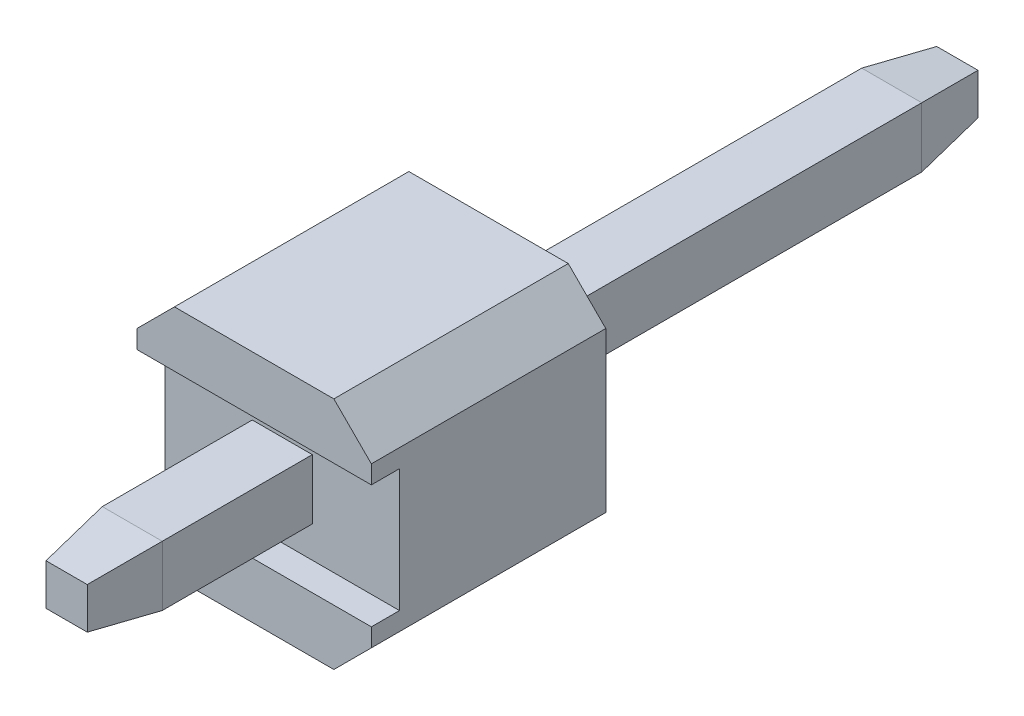
ISO-10303-21;
HEADER;
FILE_DESCRIPTION(('STEP AP214'),'2;1');
FILE_NAME('part.step','',(''),(''),'','','');
FILE_SCHEMA(('AUTOMOTIVE_DESIGN { 1 0 10303 214 1 1 1 1 }'));
ENDSEC;
DATA;
#1=APPLICATION_CONTEXT('core data for automotive mechanical design processes');
#2=APPLICATION_PROTOCOL_DEFINITION('international standard','automotive_design',2000,#1);
#3=PRODUCT_CONTEXT('',#1,'mechanical');
#4=PRODUCT('Part','Part','',(#3));
#5=PRODUCT_RELATED_PRODUCT_CATEGORY('part','',(#4));
#6=PRODUCT_DEFINITION_FORMATION('','',#4);
#7=PRODUCT_DEFINITION_CONTEXT('part definition',#1,'design');
#8=PRODUCT_DEFINITION('design','',#6,#7);
#9=PRODUCT_DEFINITION_SHAPE('','',#8);
#10=(LENGTH_UNIT() NAMED_UNIT(*) SI_UNIT(.MILLI.,.METRE.));
#11=(NAMED_UNIT(*) PLANE_ANGLE_UNIT() SI_UNIT($,.RADIAN.));
#12=(NAMED_UNIT(*) SI_UNIT($,.STERADIAN.) SOLID_ANGLE_UNIT());
#13=UNCERTAINTY_MEASURE_WITH_UNIT(LENGTH_MEASURE(1.E-05),#10,'distance_accuracy_value','');
#14=(GEOMETRIC_REPRESENTATION_CONTEXT(3) GLOBAL_UNCERTAINTY_ASSIGNED_CONTEXT((#13)) GLOBAL_UNIT_ASSIGNED_CONTEXT((#10,
#11,#12)) REPRESENTATION_CONTEXT('',''));
#15=CARTESIAN_POINT('',(0.,0.,0.));
#16=DIRECTION('',(0.,0.,1.));
#17=DIRECTION('',(1.,0.,0.));
#18=AXIS2_PLACEMENT_3D('',#15,#16,#17);
#19=CARTESIAN_POINT('',(-0.16,-0.27,-4.65));
#20=DIRECTION('',(0.,-0.989949493661167,-0.14142135623731));
#21=DIRECTION('',(0.,0.14142135623731,-0.989949493661167));
#22=AXIS2_PLACEMENT_3D('',#19,#20,#21);
#23=PLANE('',#22);
#24=DIRECTION('',(1.,0.,0.));
#25=VECTOR('',#24,1.);
#26=CARTESIAN_POINT('',(-0.16,-0.22,-5.));
#27=LINE('',#26,#25);
#28=CARTESIAN_POINT('',(-0.22,-0.22,-5.));
#29=VERTEX_POINT('',#28);
#30=CARTESIAN_POINT('',(0.22,-0.22,-5.));
#31=VERTEX_POINT('',#30);
#32=EDGE_CURVE('P0_E11',#29,#31,#27,.T.);
#33=ORIENTED_EDGE('',*,*,#32,.T.);
#34=DIRECTION('',(0.140028008402801,-0.140028008402801,0.980196058819607));
#35=VECTOR('',#34,1.);
#36=CARTESIAN_POINT('',(0.22,-0.22,-5.));
#37=LINE('',#36,#35);
#38=CARTESIAN_POINT('',(0.32,-0.32,-4.3));
#39=VERTEX_POINT('',#38);
#40=EDGE_CURVE('P0_E28',#31,#39,#37,.T.);
#41=ORIENTED_EDGE('',*,*,#40,.T.);
#42=DIRECTION('',(-1.,0.,0.));
#43=VECTOR('',#42,1.);
#44=CARTESIAN_POINT('',(-0.16,-0.32,-4.3));
#45=LINE('',#44,#43);
#46=CARTESIAN_POINT('',(-0.32,-0.32,-4.3));
#47=VERTEX_POINT('',#46);
#48=EDGE_CURVE('P0_E134',#39,#47,#45,.T.);
#49=ORIENTED_EDGE('',*,*,#48,.T.);
#50=DIRECTION('',(-0.140028008402801,-0.140028008402801,0.980196058819607));
#51=VECTOR('',#50,1.);
#52=CARTESIAN_POINT('',(-0.22,-0.22,-5.));
#53=LINE('',#52,#51);
#54=EDGE_CURVE('P0_E21',#29,#47,#53,.T.);
#55=ORIENTED_EDGE('',*,*,#54,.F.);
#56=EDGE_LOOP('',(#33,#41,#49,#55));
#57=FACE_BOUND('',#56,.T.);
#58=ADVANCED_FACE('P0_F17',(#57),#23,.T.);
#59=CARTESIAN_POINT('',(0.27,-0.16,-4.65));
#60=DIRECTION('',(0.989949493661167,0.,-0.14142135623731));
#61=DIRECTION('',(0.,-1.,0.));
#62=AXIS2_PLACEMENT_3D('',#59,#60,#61);
#63=PLANE('',#62);
#64=DIRECTION('',(0.,1.,0.));
#65=VECTOR('',#64,1.);
#66=CARTESIAN_POINT('',(0.22,-0.16,-5.));
#67=LINE('',#66,#65);
#68=CARTESIAN_POINT('',(0.22,0.22,-5.));
#69=VERTEX_POINT('',#68);
#70=EDGE_CURVE('P0_E138',#31,#69,#67,.T.);
#71=ORIENTED_EDGE('',*,*,#70,.T.);
#72=DIRECTION('',(0.140028008402801,0.140028008402801,0.980196058819607));
#73=VECTOR('',#72,1.);
#74=CARTESIAN_POINT('',(0.22,0.22,-5.));
#75=LINE('',#74,#73);
#76=CARTESIAN_POINT('',(0.32,0.32,-4.3));
#77=VERTEX_POINT('',#76);
#78=EDGE_CURVE('P0_E112',#69,#77,#75,.T.);
#79=ORIENTED_EDGE('',*,*,#78,.T.);
#80=DIRECTION('',(0.,-1.,0.));
#81=VECTOR('',#80,1.);
#82=CARTESIAN_POINT('',(0.32,-0.16,-4.3));
#83=LINE('',#82,#81);
#84=EDGE_CURVE('P0_E116',#77,#39,#83,.T.);
#85=ORIENTED_EDGE('',*,*,#84,.T.);
#86=ORIENTED_EDGE('',*,*,#40,.F.);
#87=EDGE_LOOP('',(#71,#79,#85,#86));
#88=FACE_BOUND('',#87,.T.);
#89=ADVANCED_FACE('P0_F201',(#88),#63,.T.);
#90=CARTESIAN_POINT('',(0.16,0.27,-4.65));
#91=DIRECTION('',(0.,0.989949493661167,-0.14142135623731));
#92=DIRECTION('',(-1.,0.,0.));
#93=AXIS2_PLACEMENT_3D('',#90,#91,#92);
#94=PLANE('',#93);
#95=DIRECTION('',(-1.,0.,0.));
#96=VECTOR('',#95,1.);
#97=CARTESIAN_POINT('',(0.16,0.22,-5.));
#98=LINE('',#97,#96);
#99=CARTESIAN_POINT('',(-0.22,0.22,-5.));
#100=VERTEX_POINT('',#99);
#101=EDGE_CURVE('P0_E106',#69,#100,#98,.T.);
#102=ORIENTED_EDGE('',*,*,#101,.T.);
#103=DIRECTION('',(-0.140028008402801,0.140028008402801,0.980196058819607));
#104=VECTOR('',#103,1.);
#105=CARTESIAN_POINT('',(-0.22,0.22,-5.));
#106=LINE('',#105,#104);
#107=CARTESIAN_POINT('',(-0.32,0.32,-4.3));
#108=VERTEX_POINT('',#107);
#109=EDGE_CURVE('P0_E98',#100,#108,#106,.T.);
#110=ORIENTED_EDGE('',*,*,#109,.T.);
#111=DIRECTION('',(1.,0.,0.));
#112=VECTOR('',#111,1.);
#113=CARTESIAN_POINT('',(0.16,0.32,-4.3));
#114=LINE('',#113,#112);
#115=EDGE_CURVE('P0_E107',#108,#77,#114,.T.);
#116=ORIENTED_EDGE('',*,*,#115,.T.);
#117=ORIENTED_EDGE('',*,*,#78,.F.);
#118=EDGE_LOOP('',(#102,#110,#116,#117));
#119=FACE_BOUND('',#118,.T.);
#120=ADVANCED_FACE('P0_F110',(#119),#94,.T.);
#121=CARTESIAN_POINT('',(-0.27,0.16,-4.65));
#122=DIRECTION('',(-0.989949493661167,0.,-0.14142135623731));
#123=DIRECTION('',(-0.14142135623731,0.,0.989949493661167));
#124=AXIS2_PLACEMENT_3D('',#121,#122,#123);
#125=PLANE('',#124);
#126=DIRECTION('',(0.,1.,0.));
#127=VECTOR('',#126,1.);
#128=CARTESIAN_POINT('',(-0.32,0.16,-4.3));
#129=LINE('',#128,#127);
#130=EDGE_CURVE('P0_E92',#47,#108,#129,.T.);
#131=ORIENTED_EDGE('',*,*,#130,.T.);
#132=ORIENTED_EDGE('',*,*,#109,.F.);
#133=DIRECTION('',(0.,-1.,0.));
#134=VECTOR('',#133,1.);
#135=CARTESIAN_POINT('',(-0.22,0.16,-5.));
#136=LINE('',#135,#134);
#137=EDGE_CURVE('P0_E102',#100,#29,#136,.T.);
#138=ORIENTED_EDGE('',*,*,#137,.T.);
#139=ORIENTED_EDGE('',*,*,#54,.T.);
#140=EDGE_LOOP('',(#131,#132,#138,#139));
#141=FACE_BOUND('',#140,.T.);
#142=ADVANCED_FACE('P0_F100',(#141),#125,.T.);
#143=CARTESIAN_POINT('',(-0.32,0.32,0.));
#144=DIRECTION('',(-1.,0.,0.));
#145=DIRECTION('',(0.,0.,1.));
#146=AXIS2_PLACEMENT_3D('',#143,#144,#145);
#147=PLANE('',#146);
#148=ORIENTED_EDGE('',*,*,#130,.F.);
#149=DIRECTION('',(0.,0.,1.));
#150=VECTOR('',#149,1.);
#151=CARTESIAN_POINT('',(-0.32,-0.32,0.));
#152=LINE('',#151,#150);
#153=CARTESIAN_POINT('',(-0.32,-0.32,2.));
#154=VERTEX_POINT('',#153);
#155=EDGE_CURVE('P0_E128',#47,#154,#152,.T.);
#156=ORIENTED_EDGE('',*,*,#155,.T.);
#157=DIRECTION('',(0.,-1.,0.));
#158=VECTOR('',#157,1.);
#159=CARTESIAN_POINT('',(-0.32,0.16,2.));
#160=LINE('',#159,#158);
#161=CARTESIAN_POINT('',(-0.32,0.32,2.));
#162=VERTEX_POINT('',#161);
#163=EDGE_CURVE('P0_E142',#162,#154,#160,.T.);
#164=ORIENTED_EDGE('',*,*,#163,.F.);
#165=DIRECTION('',(0.,0.,1.));
#166=VECTOR('',#165,1.);
#167=CARTESIAN_POINT('',(-0.32,0.32,0.));
#168=LINE('',#167,#166);
#169=EDGE_CURVE('P0_E133',#108,#162,#168,.T.);
#170=ORIENTED_EDGE('',*,*,#169,.F.);
#171=EDGE_LOOP('',(#148,#156,#164,#170));
#172=FACE_BOUND('',#171,.T.);
#173=ADVANCED_FACE('P0_F190',(#172),#147,.T.);
#174=CARTESIAN_POINT('',(-0.32,-0.32,0.));
#175=DIRECTION('',(0.,-1.,0.));
#176=DIRECTION('',(0.,0.,-1.));
#177=AXIS2_PLACEMENT_3D('',#174,#175,#176);
#178=PLANE('',#177);
#179=ORIENTED_EDGE('',*,*,#48,.F.);
#180=DIRECTION('',(0.,0.,1.));
#181=VECTOR('',#180,1.);
#182=CARTESIAN_POINT('',(0.32,-0.32,0.));
#183=LINE('',#182,#181);
#184=CARTESIAN_POINT('',(0.32,-0.32,2.));
#185=VERTEX_POINT('',#184);
#186=EDGE_CURVE('P0_E130',#39,#185,#183,.T.);
#187=ORIENTED_EDGE('',*,*,#186,.T.);
#188=DIRECTION('',(1.,0.,0.));
#189=VECTOR('',#188,1.);
#190=CARTESIAN_POINT('',(-0.16,-0.32,2.));
#191=LINE('',#190,#189);
#192=EDGE_CURVE('P0_E75',#154,#185,#191,.T.);
#193=ORIENTED_EDGE('',*,*,#192,.F.);
#194=ORIENTED_EDGE('',*,*,#155,.F.);
#195=EDGE_LOOP('',(#179,#187,#193,#194));
#196=FACE_BOUND('',#195,.T.);
#197=ADVANCED_FACE('P0_F188',(#196),#178,.T.);
#198=CARTESIAN_POINT('',(0.,0.,-5.));
#199=DIRECTION('',(0.,0.,-1.));
#200=DIRECTION('',(0.,-1.,0.));
#201=AXIS2_PLACEMENT_3D('',#198,#199,#200);
#202=PLANE('',#201);
#203=ORIENTED_EDGE('',*,*,#32,.F.);
#204=ORIENTED_EDGE('',*,*,#137,.F.);
#205=ORIENTED_EDGE('',*,*,#101,.F.);
#206=ORIENTED_EDGE('',*,*,#70,.F.);
#207=EDGE_LOOP('',(#203,#204,#205,#206));
#208=FACE_BOUND('',#207,.T.);
#209=ADVANCED_FACE('P0_F119',(#208),#202,.T.);
#210=CARTESIAN_POINT('',(0.32,-0.32,0.));
#211=DIRECTION('',(1.,0.,0.));
#212=DIRECTION('',(0.,1.,0.));
#213=AXIS2_PLACEMENT_3D('',#210,#211,#212);
#214=PLANE('',#213);
#215=ORIENTED_EDGE('',*,*,#84,.F.);
#216=DIRECTION('',(0.,0.,-1.));
#217=VECTOR('',#216,1.);
#218=CARTESIAN_POINT('',(0.32,0.32,0.));
#219=LINE('',#218,#217);
#220=CARTESIAN_POINT('',(0.32,0.32,2.));
#221=VERTEX_POINT('',#220);
#222=EDGE_CURVE('P0_E147',#221,#77,#219,.T.);
#223=ORIENTED_EDGE('',*,*,#222,.F.);
#224=DIRECTION('',(0.,1.,0.));
#225=VECTOR('',#224,1.);
#226=CARTESIAN_POINT('',(0.32,-0.16,2.));
#227=LINE('',#226,#225);
#228=EDGE_CURVE('P0_E69',#185,#221,#227,.T.);
#229=ORIENTED_EDGE('',*,*,#228,.F.);
#230=ORIENTED_EDGE('',*,*,#186,.F.);
#231=EDGE_LOOP('',(#215,#223,#229,#230));
#232=FACE_BOUND('',#231,.T.);
#233=ADVANCED_FACE('P0_F186',(#232),#214,.T.);
#234=CARTESIAN_POINT('',(0.32,0.32,0.));
#235=DIRECTION('',(0.,1.,0.));
#236=DIRECTION('',(1.,0.,0.));
#237=AXIS2_PLACEMENT_3D('',#234,#235,#236);
#238=PLANE('',#237);
#239=ORIENTED_EDGE('',*,*,#115,.F.);
#240=ORIENTED_EDGE('',*,*,#169,.T.);
#241=DIRECTION('',(-1.,0.,0.));
#242=VECTOR('',#241,1.);
#243=CARTESIAN_POINT('',(0.16,0.32,2.));
#244=LINE('',#243,#242);
#245=EDGE_CURVE('P0_E144',#221,#162,#244,.T.);
#246=ORIENTED_EDGE('',*,*,#245,.F.);
#247=ORIENTED_EDGE('',*,*,#222,.T.);
#248=EDGE_LOOP('',(#239,#240,#246,#247));
#249=FACE_BOUND('',#248,.T.);
#250=ADVANCED_FACE('P0_F191',(#249),#238,.T.);
#251=CARTESIAN_POINT('',(0.,0.,2.));
#252=DIRECTION('',(0.,0.,1.));
#253=DIRECTION('',(1.,0.,0.));
#254=AXIS2_PLACEMENT_3D('',#251,#252,#253);
#255=PLANE('',#254);
#256=ORIENTED_EDGE('',*,*,#245,.T.);
#257=ORIENTED_EDGE('',*,*,#163,.T.);
#258=ORIENTED_EDGE('',*,*,#192,.T.);
#259=ORIENTED_EDGE('',*,*,#228,.T.);
#260=EDGE_LOOP('',(#256,#257,#258,#259));
#261=FACE_BOUND('',#260,.T.);
#262=ADVANCED_FACE('P0_F19',(#261),#255,.T.);
#263=CLOSED_SHELL('',(#58,#89,#120,#142,#173,#197,#209,#233,#250,#262));
#264=MANIFOLD_SOLID_BREP('P0_B1',#263);
#265=CARTESIAN_POINT('',(-1.25,0.655430015301126,2.5));
#266=DIRECTION('',(0.,1.,0.));
#267=DIRECTION('',(1.,0.,0.));
#268=AXIS2_PLACEMENT_3D('',#265,#266,#267);
#269=PLANE('',#268);
#270=DIRECTION('',(1.,0.,0.));
#271=VECTOR('',#270,1.);
#272=CARTESIAN_POINT('',(-0.625,0.655430015301126,2.5));
#273=LINE('',#272,#271);
#274=CARTESIAN_POINT('',(-1.25,0.655430015301126,2.5));
#275=VERTEX_POINT('',#274);
#276=CARTESIAN_POINT('',(1.25,0.655430015301126,2.5));
#277=VERTEX_POINT('',#276);
#278=EDGE_CURVE('P1_E214',#275,#277,#273,.T.);
#279=ORIENTED_EDGE('',*,*,#278,.F.);
#280=DIRECTION('',(0.,0.,1.));
#281=VECTOR('',#280,1.);
#282=CARTESIAN_POINT('',(-1.25,0.655430015301126,1.25));
#283=LINE('',#282,#281);
#284=CARTESIAN_POINT('',(-1.25,0.655430015301126,2.2));
#285=VERTEX_POINT('',#284);
#286=EDGE_CURVE('P1_E41',#285,#275,#283,.T.);
#287=ORIENTED_EDGE('',*,*,#286,.F.);
#288=DIRECTION('',(1.,0.,0.));
#289=VECTOR('',#288,1.);
#290=CARTESIAN_POINT('',(-1.25,0.655430015301126,2.2));
#291=LINE('',#290,#289);
#292=CARTESIAN_POINT('',(1.25,0.655430015301126,2.2));
#293=VERTEX_POINT('',#292);
#294=EDGE_CURVE('P1_E11',#285,#293,#291,.T.);
#295=ORIENTED_EDGE('',*,*,#294,.T.);
#296=DIRECTION('',(0.,0.,-1.));
#297=VECTOR('',#296,1.);
#298=CARTESIAN_POINT('',(1.25,0.655430015301126,1.25));
#299=LINE('',#298,#297);
#300=EDGE_CURVE('P1_E269',#277,#293,#299,.T.);
#301=ORIENTED_EDGE('',*,*,#300,.F.);
#302=EDGE_LOOP('',(#279,#287,#295,#301));
#303=FACE_BOUND('',#302,.T.);
#304=ADVANCED_FACE('P1_F17',(#303),#269,.F.);
#305=CARTESIAN_POINT('',(1.25,-0.655430015301126,2.5));
#306=DIRECTION('',(0.,-1.,0.));
#307=DIRECTION('',(0.,0.,-1.));
#308=AXIS2_PLACEMENT_3D('',#305,#306,#307);
#309=PLANE('',#308);
#310=DIRECTION('',(-1.,0.,0.));
#311=VECTOR('',#310,1.);
#312=CARTESIAN_POINT('',(0.625,-0.655430015301126,2.5));
#313=LINE('',#312,#311);
#314=CARTESIAN_POINT('',(1.25,-0.655430015301126,2.5));
#315=VERTEX_POINT('',#314);
#316=CARTESIAN_POINT('',(-1.25,-0.655430015301126,2.5));
#317=VERTEX_POINT('',#316);
#318=EDGE_CURVE('P1_E184',#315,#317,#313,.T.);
#319=ORIENTED_EDGE('',*,*,#318,.F.);
#320=DIRECTION('',(0.,0.,1.));
#321=VECTOR('',#320,1.);
#322=CARTESIAN_POINT('',(1.25,-0.655430015301126,1.25));
#323=LINE('',#322,#321);
#324=CARTESIAN_POINT('',(1.25,-0.655430015301126,2.2));
#325=VERTEX_POINT('',#324);
#326=EDGE_CURVE('P1_E286',#325,#315,#323,.T.);
#327=ORIENTED_EDGE('',*,*,#326,.F.);
#328=DIRECTION('',(-1.,0.,0.));
#329=VECTOR('',#328,1.);
#330=CARTESIAN_POINT('',(1.25,-0.655430015301126,2.2));
#331=LINE('',#330,#329);
#332=CARTESIAN_POINT('',(-1.25,-0.655430015301126,2.2));
#333=VERTEX_POINT('',#332);
#334=EDGE_CURVE('P1_E21',#325,#333,#331,.T.);
#335=ORIENTED_EDGE('',*,*,#334,.T.);
#336=DIRECTION('',(0.,0.,-1.));
#337=VECTOR('',#336,1.);
#338=CARTESIAN_POINT('',(-1.25,-0.655430015301126,1.25));
#339=LINE('',#338,#337);
#340=EDGE_CURVE('P1_E226',#317,#333,#339,.T.);
#341=ORIENTED_EDGE('',*,*,#340,.F.);
#342=EDGE_LOOP('',(#319,#327,#335,#341));
#343=FACE_BOUND('',#342,.T.);
#344=ADVANCED_FACE('P1_F546',(#343),#309,.F.);
#345=CARTESIAN_POINT('',(0.,0.,2.2));
#346=DIRECTION('',(0.,0.,-1.));
#347=DIRECTION('',(0.,-1.,0.));
#348=AXIS2_PLACEMENT_3D('',#345,#346,#347);
#349=PLANE('',#348);
#350=DIRECTION('',(0.,-1.,0.));
#351=VECTOR('',#350,1.);
#352=CARTESIAN_POINT('',(1.25,-0.625,2.2));
#353=LINE('',#352,#351);
#354=EDGE_CURVE('P1_E272',#293,#325,#353,.T.);
#355=ORIENTED_EDGE('',*,*,#354,.F.);
#356=ORIENTED_EDGE('',*,*,#294,.F.);
#357=DIRECTION('',(0.,1.,0.));
#358=VECTOR('',#357,1.);
#359=CARTESIAN_POINT('',(-1.25,0.625,2.2));
#360=LINE('',#359,#358);
#361=EDGE_CURVE('P1_E223',#333,#285,#360,.T.);
#362=ORIENTED_EDGE('',*,*,#361,.F.);
#363=ORIENTED_EDGE('',*,*,#334,.F.);
#364=EDGE_LOOP('',(#355,#356,#362,#363));
#365=FACE_BOUND('',#364,.T.);
#366=DIRECTION('',(0.,-1.,0.));
#367=VECTOR('',#366,1.);
#368=CARTESIAN_POINT('',(-0.32,-0.16,2.2));
#369=LINE('',#368,#367);
#370=CARTESIAN_POINT('',(-0.32,0.32,2.2));
#371=VERTEX_POINT('',#370);
#372=CARTESIAN_POINT('',(-0.32,-0.32,2.2));
#373=VERTEX_POINT('',#372);
#374=EDGE_CURVE('P1_E221',#371,#373,#369,.T.);
#375=ORIENTED_EDGE('',*,*,#374,.F.);
#376=DIRECTION('',(-1.,0.,0.));
#377=VECTOR('',#376,1.);
#378=CARTESIAN_POINT('',(-0.16,0.32,2.2));
#379=LINE('',#378,#377);
#380=CARTESIAN_POINT('',(0.32,0.32,2.2));
#381=VERTEX_POINT('',#380);
#382=EDGE_CURVE('P1_E259',#381,#371,#379,.T.);
#383=ORIENTED_EDGE('',*,*,#382,.F.);
#384=DIRECTION('',(0.,1.,0.));
#385=VECTOR('',#384,1.);
#386=CARTESIAN_POINT('',(0.32,0.16,2.2));
#387=LINE('',#386,#385);
#388=CARTESIAN_POINT('',(0.32,-0.32,2.2));
#389=VERTEX_POINT('',#388);
#390=EDGE_CURVE('P1_E290',#389,#381,#387,.T.);
#391=ORIENTED_EDGE('',*,*,#390,.F.);
#392=DIRECTION('',(1.,0.,0.));
#393=VECTOR('',#392,1.);
#394=CARTESIAN_POINT('',(0.16,-0.32,2.2));
#395=LINE('',#394,#393);
#396=EDGE_CURVE('P1_E277',#373,#389,#395,.T.);
#397=ORIENTED_EDGE('',*,*,#396,.F.);
#398=EDGE_LOOP('',(#375,#383,#391,#397));
#399=FACE_BOUND('',#398,.T.);
#400=ADVANCED_FACE('P1_F551',(#365,#399),#349,.F.);
#401=CARTESIAN_POINT('',(0.,0.,2.5));
#402=DIRECTION('',(0.,0.,1.));
#403=DIRECTION('',(1.,0.,0.));
#404=AXIS2_PLACEMENT_3D('',#401,#402,#403);
#405=PLANE('',#404);
#406=ORIENTED_EDGE('',*,*,#318,.T.);
#407=DIRECTION('',(0.,-1.,0.));
#408=VECTOR('',#407,1.);
#409=CARTESIAN_POINT('',(-1.25,-1.25,2.5));
#410=LINE('',#409,#408);
#411=CARTESIAN_POINT('',(-1.25,-0.85,2.5));
#412=VERTEX_POINT('',#411);
#413=EDGE_CURVE('P1_E181',#317,#412,#410,.T.);
#414=ORIENTED_EDGE('',*,*,#413,.T.);
#415=DIRECTION('',(-0.707106781186548,0.707106781186548,0.));
#416=VECTOR('',#415,1.);
#417=CARTESIAN_POINT('',(-1.05,-1.05,2.5));
#418=LINE('',#417,#416);
#419=CARTESIAN_POINT('',(-0.85,-1.25,2.5));
#420=VERTEX_POINT('',#419);
#421=EDGE_CURVE('P1_E166',#420,#412,#418,.T.);
#422=ORIENTED_EDGE('',*,*,#421,.F.);
#423=DIRECTION('',(1.,0.,0.));
#424=VECTOR('',#423,1.);
#425=CARTESIAN_POINT('',(1.25,-1.25,2.5));
#426=LINE('',#425,#424);
#427=CARTESIAN_POINT('',(0.85,-1.25,2.5));
#428=VERTEX_POINT('',#427);
#429=EDGE_CURVE('P1_E187',#420,#428,#426,.T.);
#430=ORIENTED_EDGE('',*,*,#429,.T.);
#431=DIRECTION('',(-0.707106781186548,-0.707106781186548,0.));
#432=VECTOR('',#431,1.);
#433=CARTESIAN_POINT('',(1.05,-1.05,2.5));
#434=LINE('',#433,#432);
#435=CARTESIAN_POINT('',(1.25,-0.85,2.5));
#436=VERTEX_POINT('',#435);
#437=EDGE_CURVE('P1_E240',#436,#428,#434,.T.);
#438=ORIENTED_EDGE('',*,*,#437,.F.);
#439=DIRECTION('',(0.,1.,0.));
#440=VECTOR('',#439,1.);
#441=CARTESIAN_POINT('',(1.25,1.25,2.5));
#442=LINE('',#441,#440);
#443=EDGE_CURVE('P1_E215',#436,#315,#442,.T.);
#444=ORIENTED_EDGE('',*,*,#443,.T.);
#445=EDGE_LOOP('',(#406,#414,#422,#430,#438,#444));
#446=FACE_BOUND('',#445,.T.);
#447=ADVANCED_FACE('P1_F19',(#446),#405,.T.);
#448=CARTESIAN_POINT('',(0.,0.,2.5));
#449=DIRECTION('',(0.,0.,1.));
#450=DIRECTION('',(1.,0.,0.));
#451=AXIS2_PLACEMENT_3D('',#448,#449,#450);
#452=PLANE('',#451);
#453=ORIENTED_EDGE('',*,*,#278,.T.);
#454=DIRECTION('',(0.,1.,0.));
#455=VECTOR('',#454,1.);
#456=CARTESIAN_POINT('',(1.25,1.25,2.5));
#457=LINE('',#456,#455);
#458=CARTESIAN_POINT('',(1.25,0.85,2.5));
#459=VERTEX_POINT('',#458);
#460=EDGE_CURVE('P1_E207',#277,#459,#457,.T.);
#461=ORIENTED_EDGE('',*,*,#460,.T.);
#462=DIRECTION('',(0.707106781186548,-0.707106781186548,0.));
#463=VECTOR('',#462,1.);
#464=CARTESIAN_POINT('',(1.05,1.05,2.5));
#465=LINE('',#464,#463);
#466=CARTESIAN_POINT('',(0.85,1.25,2.5));
#467=VERTEX_POINT('',#466);
#468=EDGE_CURVE('P1_E295',#467,#459,#465,.T.);
#469=ORIENTED_EDGE('',*,*,#468,.F.);
#470=DIRECTION('',(-1.,0.,0.));
#471=VECTOR('',#470,1.);
#472=CARTESIAN_POINT('',(-1.25,1.25,2.5));
#473=LINE('',#472,#471);
#474=CARTESIAN_POINT('',(-0.85,1.25,2.5));
#475=VERTEX_POINT('',#474);
#476=EDGE_CURVE('P1_E203',#467,#475,#473,.T.);
#477=ORIENTED_EDGE('',*,*,#476,.T.);
#478=DIRECTION('',(0.707106781186548,0.707106781186548,0.));
#479=VECTOR('',#478,1.);
#480=CARTESIAN_POINT('',(-1.05,1.05,2.5));
#481=LINE('',#480,#479);
#482=CARTESIAN_POINT('',(-1.25,0.85,2.5));
#483=VERTEX_POINT('',#482);
#484=EDGE_CURVE('P1_E249',#483,#475,#481,.T.);
#485=ORIENTED_EDGE('',*,*,#484,.F.);
#486=DIRECTION('',(0.,-1.,0.));
#487=VECTOR('',#486,1.);
#488=CARTESIAN_POINT('',(-1.25,-1.25,2.5));
#489=LINE('',#488,#487);
#490=EDGE_CURVE('P1_E208',#483,#275,#489,.T.);
#491=ORIENTED_EDGE('',*,*,#490,.T.);
#492=EDGE_LOOP('',(#453,#461,#469,#477,#485,#491));
#493=FACE_BOUND('',#492,.T.);
#494=ADVANCED_FACE('P1_F347',(#493),#452,.T.);
#495=CARTESIAN_POINT('',(1.25,-1.25,0.));
#496=DIRECTION('',(1.,0.,0.));
#497=DIRECTION('',(0.,1.,0.));
#498=AXIS2_PLACEMENT_3D('',#495,#496,#497);
#499=PLANE('',#498);
#500=ORIENTED_EDGE('',*,*,#300,.T.);
#501=ORIENTED_EDGE('',*,*,#354,.T.);
#502=ORIENTED_EDGE('',*,*,#326,.T.);
#503=ORIENTED_EDGE('',*,*,#443,.F.);
#504=DIRECTION('',(0.,0.,1.));
#505=VECTOR('',#504,1.);
#506=CARTESIAN_POINT('',(1.25,-0.85,0.));
#507=LINE('',#506,#505);
#508=CARTESIAN_POINT('',(1.25,-0.85,0.));
#509=VERTEX_POINT('',#508);
#510=EDGE_CURVE('P1_E230',#509,#436,#507,.T.);
#511=ORIENTED_EDGE('',*,*,#510,.F.);
#512=DIRECTION('',(0.,-1.,0.));
#513=VECTOR('',#512,1.);
#514=CARTESIAN_POINT('',(1.25,1.25,0.));
#515=LINE('',#514,#513);
#516=CARTESIAN_POINT('',(1.25,0.85,0.));
#517=VERTEX_POINT('',#516);
#518=EDGE_CURVE('P1_E239',#517,#509,#515,.T.);
#519=ORIENTED_EDGE('',*,*,#518,.F.);
#520=DIRECTION('',(0.,0.,-1.));
#521=VECTOR('',#520,1.);
#522=CARTESIAN_POINT('',(1.25,0.85,0.));
#523=LINE('',#522,#521);
#524=EDGE_CURVE('P1_E201',#459,#517,#523,.T.);
#525=ORIENTED_EDGE('',*,*,#524,.F.);
#526=ORIENTED_EDGE('',*,*,#460,.F.);
#527=EDGE_LOOP('',(#500,#501,#502,#503,#511,#519,#525,#526));
#528=FACE_BOUND('',#527,.T.);
#529=ADVANCED_FACE('P1_F352',(#528),#499,.T.);
#530=CARTESIAN_POINT('',(0.32,0.32,0.));
#531=DIRECTION('',(-1.,0.,0.));
#532=DIRECTION('',(0.,0.,1.));
#533=AXIS2_PLACEMENT_3D('',#530,#531,#532);
#534=PLANE('',#533);
#535=ORIENTED_EDGE('',*,*,#390,.T.);
#536=DIRECTION('',(0.,0.,1.));
#537=VECTOR('',#536,1.);
#538=CARTESIAN_POINT('',(0.32,0.32,0.));
#539=LINE('',#538,#537);
#540=CARTESIAN_POINT('',(0.32,0.32,0.));
#541=VERTEX_POINT('',#540);
#542=EDGE_CURVE('P1_E177',#541,#381,#539,.T.);
#543=ORIENTED_EDGE('',*,*,#542,.F.);
#544=DIRECTION('',(0.,-1.,0.));
#545=VECTOR('',#544,1.);
#546=CARTESIAN_POINT('',(0.32,0.32,0.));
#547=LINE('',#546,#545);
#548=CARTESIAN_POINT('',(0.32,-0.32,0.));
#549=VERTEX_POINT('',#548);
#550=EDGE_CURVE('P1_E306',#541,#549,#547,.T.);
#551=ORIENTED_EDGE('',*,*,#550,.T.);
#552=DIRECTION('',(0.,0.,1.));
#553=VECTOR('',#552,1.);
#554=CARTESIAN_POINT('',(0.32,-0.32,0.));
#555=LINE('',#554,#553);
#556=EDGE_CURVE('P1_E110',#549,#389,#555,.T.);
#557=ORIENTED_EDGE('',*,*,#556,.T.);
#558=EDGE_LOOP('',(#535,#543,#551,#557));
#559=FACE_BOUND('',#558,.T.);
#560=ADVANCED_FACE('P1_F523',(#559),#534,.T.);
#561=CARTESIAN_POINT('',(-0.32,0.32,0.));
#562=DIRECTION('',(0.,-1.,0.));
#563=DIRECTION('',(0.,0.,-1.));
#564=AXIS2_PLACEMENT_3D('',#561,#562,#563);
#565=PLANE('',#564);
#566=ORIENTED_EDGE('',*,*,#382,.T.);
#567=DIRECTION('',(0.,0.,1.));
#568=VECTOR('',#567,1.);
#569=CARTESIAN_POINT('',(-0.32,0.32,0.));
#570=LINE('',#569,#568);
#571=CARTESIAN_POINT('',(-0.32,0.32,0.));
#572=VERTEX_POINT('',#571);
#573=EDGE_CURVE('P1_E120',#572,#371,#570,.T.);
#574=ORIENTED_EDGE('',*,*,#573,.F.);
#575=DIRECTION('',(1.,0.,0.));
#576=VECTOR('',#575,1.);
#577=CARTESIAN_POINT('',(-0.32,0.32,0.));
#578=LINE('',#577,#576);
#579=EDGE_CURVE('P1_E256',#572,#541,#578,.T.);
#580=ORIENTED_EDGE('',*,*,#579,.T.);
#581=ORIENTED_EDGE('',*,*,#542,.T.);
#582=EDGE_LOOP('',(#566,#574,#580,#581));
#583=FACE_BOUND('',#582,.T.);
#584=ADVANCED_FACE('P1_F567',(#583),#565,.T.);
#585=CARTESIAN_POINT('',(-1.05,-1.05,0.));
#586=DIRECTION('',(-0.707106781186548,-0.707106781186548,0.));
#587=DIRECTION('',(-0.707106781186548,0.707106781186548,0.));
#588=AXIS2_PLACEMENT_3D('',#585,#586,#587);
#589=PLANE('',#588);
#590=ORIENTED_EDGE('',*,*,#421,.T.);
#591=DIRECTION('',(0.,0.,-1.));
#592=VECTOR('',#591,1.);
#593=CARTESIAN_POINT('',(-1.25,-0.85,0.));
#594=LINE('',#593,#592);
#595=CARTESIAN_POINT('',(-1.25,-0.85,0.));
#596=VERTEX_POINT('',#595);
#597=EDGE_CURVE('P1_E170',#412,#596,#594,.T.);
#598=ORIENTED_EDGE('',*,*,#597,.T.);
#599=DIRECTION('',(0.707106781186548,-0.707106781186548,0.));
#600=VECTOR('',#599,1.);
#601=CARTESIAN_POINT('',(-1.05,-1.05,0.));
#602=LINE('',#601,#600);
#603=CARTESIAN_POINT('',(-0.85,-1.25,0.));
#604=VERTEX_POINT('',#603);
#605=EDGE_CURVE('P1_E132',#596,#604,#602,.T.);
#606=ORIENTED_EDGE('',*,*,#605,.T.);
#607=DIRECTION('',(0.,0.,1.));
#608=VECTOR('',#607,1.);
#609=CARTESIAN_POINT('',(-0.85,-1.25,0.));
#610=LINE('',#609,#608);
#611=EDGE_CURVE('P1_E172',#604,#420,#610,.T.);
#612=ORIENTED_EDGE('',*,*,#611,.T.);
#613=EDGE_LOOP('',(#590,#598,#606,#612));
#614=FACE_BOUND('',#613,.T.);
#615=ADVANCED_FACE('P1_F168',(#614),#589,.T.);
#616=CARTESIAN_POINT('',(-1.25,-1.25,0.));
#617=DIRECTION('',(0.,-1.,0.));
#618=DIRECTION('',(0.,0.,-1.));
#619=AXIS2_PLACEMENT_3D('',#616,#617,#618);
#620=PLANE('',#619);
#621=ORIENTED_EDGE('',*,*,#611,.F.);
#622=DIRECTION('',(-1.,0.,0.));
#623=VECTOR('',#622,1.);
#624=CARTESIAN_POINT('',(1.25,-1.25,0.));
#625=LINE('',#624,#623);
#626=CARTESIAN_POINT('',(0.85,-1.25,0.));
#627=VERTEX_POINT('',#626);
#628=EDGE_CURVE('P1_E252',#627,#604,#625,.T.);
#629=ORIENTED_EDGE('',*,*,#628,.F.);
#630=DIRECTION('',(0.,0.,-1.));
#631=VECTOR('',#630,1.);
#632=CARTESIAN_POINT('',(0.85,-1.25,0.));
#633=LINE('',#632,#631);
#634=EDGE_CURVE('P1_E244',#428,#627,#633,.T.);
#635=ORIENTED_EDGE('',*,*,#634,.F.);
#636=ORIENTED_EDGE('',*,*,#429,.F.);
#637=EDGE_LOOP('',(#621,#629,#635,#636));
#638=FACE_BOUND('',#637,.T.);
#639=ADVANCED_FACE('P1_F505',(#638),#620,.T.);
#640=CARTESIAN_POINT('',(0.,0.,0.));
#641=DIRECTION('',(0.,0.,1.));
#642=DIRECTION('',(1.,0.,0.));
#643=AXIS2_PLACEMENT_3D('',#640,#641,#642);
#644=PLANE('',#643);
#645=ORIENTED_EDGE('',*,*,#605,.F.);
#646=DIRECTION('',(0.,1.,0.));
#647=VECTOR('',#646,1.);
#648=CARTESIAN_POINT('',(-1.25,-1.25,0.));
#649=LINE('',#648,#647);
#650=CARTESIAN_POINT('',(-1.25,0.85,0.));
#651=VERTEX_POINT('',#650);
#652=EDGE_CURVE('P1_E191',#596,#651,#649,.T.);
#653=ORIENTED_EDGE('',*,*,#652,.T.);
#654=DIRECTION('',(-0.707106781186548,-0.707106781186548,0.));
#655=VECTOR('',#654,1.);
#656=CARTESIAN_POINT('',(-1.05,1.05,0.));
#657=LINE('',#656,#655);
#658=CARTESIAN_POINT('',(-0.85,1.25,0.));
#659=VERTEX_POINT('',#658);
#660=EDGE_CURVE('P1_E263',#659,#651,#657,.T.);
#661=ORIENTED_EDGE('',*,*,#660,.F.);
#662=DIRECTION('',(1.,0.,0.));
#663=VECTOR('',#662,1.);
#664=CARTESIAN_POINT('',(-1.25,1.25,0.));
#665=LINE('',#664,#663);
#666=CARTESIAN_POINT('',(0.85,1.25,0.));
#667=VERTEX_POINT('',#666);
#668=EDGE_CURVE('P1_E235',#659,#667,#665,.T.);
#669=ORIENTED_EDGE('',*,*,#668,.T.);
#670=DIRECTION('',(-0.707106781186548,0.707106781186548,0.));
#671=VECTOR('',#670,1.);
#672=CARTESIAN_POINT('',(1.05,1.05,0.));
#673=LINE('',#672,#671);
#674=EDGE_CURVE('P1_E315',#517,#667,#673,.T.);
#675=ORIENTED_EDGE('',*,*,#674,.F.);
#676=ORIENTED_EDGE('',*,*,#518,.T.);
#677=DIRECTION('',(0.707106781186548,0.707106781186548,0.));
#678=VECTOR('',#677,1.);
#679=CARTESIAN_POINT('',(1.05,-1.05,0.));
#680=LINE('',#679,#678);
#681=EDGE_CURVE('P1_E234',#627,#509,#680,.T.);
#682=ORIENTED_EDGE('',*,*,#681,.F.);
#683=ORIENTED_EDGE('',*,*,#628,.T.);
#684=EDGE_LOOP('',(#645,#653,#661,#669,#675,#676,#682,#683));
#685=FACE_BOUND('',#684,.T.);
#686=ORIENTED_EDGE('',*,*,#579,.F.);
#687=DIRECTION('',(0.,1.,0.));
#688=VECTOR('',#687,1.);
#689=CARTESIAN_POINT('',(-0.32,-0.32,0.));
#690=LINE('',#689,#688);
#691=CARTESIAN_POINT('',(-0.32,-0.32,0.));
#692=VERTEX_POINT('',#691);
#693=EDGE_CURVE('P1_E218',#692,#572,#690,.T.);
#694=ORIENTED_EDGE('',*,*,#693,.F.);
#695=DIRECTION('',(-1.,0.,0.));
#696=VECTOR('',#695,1.);
#697=CARTESIAN_POINT('',(0.32,-0.32,0.));
#698=LINE('',#697,#696);
#699=EDGE_CURVE('P1_E268',#549,#692,#698,.T.);
#700=ORIENTED_EDGE('',*,*,#699,.F.);
#701=ORIENTED_EDGE('',*,*,#550,.F.);
#702=EDGE_LOOP('',(#686,#694,#700,#701));
#703=FACE_BOUND('',#702,.T.);
#704=ADVANCED_FACE('P1_F499',(#685,#703),#644,.F.);
#705=CARTESIAN_POINT('',(-1.05,1.05,0.));
#706=DIRECTION('',(-0.707106781186548,0.707106781186548,0.));
#707=DIRECTION('',(0.,0.,1.));
#708=AXIS2_PLACEMENT_3D('',#705,#706,#707);
#709=PLANE('',#708);
#710=ORIENTED_EDGE('',*,*,#484,.T.);
#711=DIRECTION('',(0.,0.,-1.));
#712=VECTOR('',#711,1.);
#713=CARTESIAN_POINT('',(-0.85,1.25,0.));
#714=LINE('',#713,#712);
#715=EDGE_CURVE('P1_E253',#475,#659,#714,.T.);
#716=ORIENTED_EDGE('',*,*,#715,.T.);
#717=ORIENTED_EDGE('',*,*,#660,.T.);
#718=DIRECTION('',(0.,0.,1.));
#719=VECTOR('',#718,1.);
#720=CARTESIAN_POINT('',(-1.25,0.85,0.));
#721=LINE('',#720,#719);
#722=EDGE_CURVE('P1_E280',#651,#483,#721,.T.);
#723=ORIENTED_EDGE('',*,*,#722,.T.);
#724=EDGE_LOOP('',(#710,#716,#717,#723));
#725=FACE_BOUND('',#724,.T.);
#726=ADVANCED_FACE('P1_F504',(#725),#709,.T.);
#727=CARTESIAN_POINT('',(1.25,1.25,0.));
#728=DIRECTION('',(0.,1.,0.));
#729=DIRECTION('',(1.,0.,0.));
#730=AXIS2_PLACEMENT_3D('',#727,#728,#729);
#731=PLANE('',#730);
#732=ORIENTED_EDGE('',*,*,#715,.F.);
#733=ORIENTED_EDGE('',*,*,#476,.F.);
#734=DIRECTION('',(0.,0.,1.));
#735=VECTOR('',#734,1.);
#736=CARTESIAN_POINT('',(0.85,1.25,0.));
#737=LINE('',#736,#735);
#738=EDGE_CURVE('P1_E243',#667,#467,#737,.T.);
#739=ORIENTED_EDGE('',*,*,#738,.F.);
#740=ORIENTED_EDGE('',*,*,#668,.F.);
#741=EDGE_LOOP('',(#732,#733,#739,#740));
#742=FACE_BOUND('',#741,.T.);
#743=ADVANCED_FACE('P1_F561',(#742),#731,.T.);
#744=CARTESIAN_POINT('',(1.05,1.05,0.));
#745=DIRECTION('',(0.707106781186548,0.707106781186548,0.));
#746=DIRECTION('',(0.,0.,-1.));
#747=AXIS2_PLACEMENT_3D('',#744,#745,#746);
#748=PLANE('',#747);
#749=ORIENTED_EDGE('',*,*,#468,.T.);
#750=ORIENTED_EDGE('',*,*,#524,.T.);
#751=ORIENTED_EDGE('',*,*,#674,.T.);
#752=ORIENTED_EDGE('',*,*,#738,.T.);
#753=EDGE_LOOP('',(#749,#750,#751,#752));
#754=FACE_BOUND('',#753,.T.);
#755=ADVANCED_FACE('P1_F605',(#754),#748,.T.);
#756=CARTESIAN_POINT('',(1.05,-1.05,0.));
#757=DIRECTION('',(0.707106781186548,-0.707106781186548,0.));
#758=DIRECTION('',(0.,0.,-1.));
#759=AXIS2_PLACEMENT_3D('',#756,#757,#758);
#760=PLANE('',#759);
#761=ORIENTED_EDGE('',*,*,#437,.T.);
#762=ORIENTED_EDGE('',*,*,#634,.T.);
#763=ORIENTED_EDGE('',*,*,#681,.T.);
#764=ORIENTED_EDGE('',*,*,#510,.T.);
#765=EDGE_LOOP('',(#761,#762,#763,#764));
#766=FACE_BOUND('',#765,.T.);
#767=ADVANCED_FACE('P1_F534',(#766),#760,.T.);
#768=CARTESIAN_POINT('',(-0.32,-0.32,0.));
#769=DIRECTION('',(1.,0.,0.));
#770=DIRECTION('',(0.,1.,0.));
#771=AXIS2_PLACEMENT_3D('',#768,#769,#770);
#772=PLANE('',#771);
#773=ORIENTED_EDGE('',*,*,#374,.T.);
#774=DIRECTION('',(0.,0.,1.));
#775=VECTOR('',#774,1.);
#776=CARTESIAN_POINT('',(-0.32,-0.32,0.));
#777=LINE('',#776,#775);
#778=EDGE_CURVE('P1_E264',#692,#373,#777,.T.);
#779=ORIENTED_EDGE('',*,*,#778,.F.);
#780=ORIENTED_EDGE('',*,*,#693,.T.);
#781=ORIENTED_EDGE('',*,*,#573,.T.);
#782=EDGE_LOOP('',(#773,#779,#780,#781));
#783=FACE_BOUND('',#782,.T.);
#784=ADVANCED_FACE('P1_F528',(#783),#772,.T.);
#785=CARTESIAN_POINT('',(0.32,-0.32,0.));
#786=DIRECTION('',(0.,1.,0.));
#787=DIRECTION('',(1.,0.,0.));
#788=AXIS2_PLACEMENT_3D('',#785,#786,#787);
#789=PLANE('',#788);
#790=ORIENTED_EDGE('',*,*,#396,.T.);
#791=ORIENTED_EDGE('',*,*,#556,.F.);
#792=ORIENTED_EDGE('',*,*,#699,.T.);
#793=ORIENTED_EDGE('',*,*,#778,.T.);
#794=EDGE_LOOP('',(#790,#791,#792,#793));
#795=FACE_BOUND('',#794,.T.);
#796=ADVANCED_FACE('P1_F533',(#795),#789,.T.);
#797=CARTESIAN_POINT('',(-1.25,1.25,0.));
#798=DIRECTION('',(-1.,0.,0.));
#799=DIRECTION('',(0.,0.,1.));
#800=AXIS2_PLACEMENT_3D('',#797,#798,#799);
#801=PLANE('',#800);
#802=ORIENTED_EDGE('',*,*,#286,.T.);
#803=ORIENTED_EDGE('',*,*,#490,.F.);
#804=ORIENTED_EDGE('',*,*,#722,.F.);
#805=ORIENTED_EDGE('',*,*,#652,.F.);
#806=ORIENTED_EDGE('',*,*,#597,.F.);
#807=ORIENTED_EDGE('',*,*,#413,.F.);
#808=ORIENTED_EDGE('',*,*,#340,.T.);
#809=ORIENTED_EDGE('',*,*,#361,.T.);
#810=EDGE_LOOP('',(#802,#803,#804,#805,#806,#807,#808,#809));
#811=FACE_BOUND('',#810,.T.);
#812=ADVANCED_FACE('P1_F189',(#811),#801,.T.);
#813=CLOSED_SHELL('',(#304,#344,#400,#447,#494,#529,#560,#584,#615,#639,#704,#726,#743,#755,
#767,#784,#796,#812));
#814=MANIFOLD_SOLID_BREP('P1_B1',#813);
#815=CARTESIAN_POINT('',(0.27,-0.16,4.15));
#816=DIRECTION('',(0.989949493661167,0.,0.141421356237309));
#817=DIRECTION('',(0.,-1.,0.));
#818=AXIS2_PLACEMENT_3D('',#815,#816,#817);
#819=PLANE('',#818);
#820=DIRECTION('',(0.,-1.,0.));
#821=VECTOR('',#820,1.);
#822=CARTESIAN_POINT('',(0.22,-0.16,4.5));
#823=LINE('',#822,#821);
#824=CARTESIAN_POINT('',(0.22,0.22,4.5));
#825=VERTEX_POINT('',#824);
#826=CARTESIAN_POINT('',(0.22,-0.22,4.5));
#827=VERTEX_POINT('',#826);
#828=EDGE_CURVE('P2_E11',#825,#827,#823,.T.);
#829=ORIENTED_EDGE('',*,*,#828,.T.);
#830=DIRECTION('',(0.140028008402801,-0.140028008402801,-0.980196058819607));
#831=VECTOR('',#830,1.);
#832=CARTESIAN_POINT('',(0.22,-0.22,4.5));
#833=LINE('',#832,#831);
#834=CARTESIAN_POINT('',(0.32,-0.32,3.8));
#835=VERTEX_POINT('',#834);
#836=EDGE_CURVE('P2_E28',#827,#835,#833,.T.);
#837=ORIENTED_EDGE('',*,*,#836,.T.);
#838=DIRECTION('',(0.,1.,0.));
#839=VECTOR('',#838,1.);
#840=CARTESIAN_POINT('',(0.32,-0.16,3.8));
#841=LINE('',#840,#839);
#842=CARTESIAN_POINT('',(0.32,0.32,3.8));
#843=VERTEX_POINT('',#842);
#844=EDGE_CURVE('P2_E107',#835,#843,#841,.T.);
#845=ORIENTED_EDGE('',*,*,#844,.T.);
#846=DIRECTION('',(0.140028008402801,0.140028008402801,-0.980196058819607));
#847=VECTOR('',#846,1.);
#848=CARTESIAN_POINT('',(0.22,0.22,4.5));
#849=LINE('',#848,#847);
#850=EDGE_CURVE('P2_E141',#825,#843,#849,.T.);
#851=ORIENTED_EDGE('',*,*,#850,.F.);
#852=EDGE_LOOP('',(#829,#837,#845,#851));
#853=FACE_BOUND('',#852,.T.);
#854=ADVANCED_FACE('P2_F17',(#853),#819,.T.);
#855=CARTESIAN_POINT('',(-0.16,-0.27,4.15));
#856=DIRECTION('',(0.,-0.989949493661167,0.141421356237309));
#857=DIRECTION('',(-1.,0.,0.));
#858=AXIS2_PLACEMENT_3D('',#855,#856,#857);
#859=PLANE('',#858);
#860=DIRECTION('',(-1.,0.,0.));
#861=VECTOR('',#860,1.);
#862=CARTESIAN_POINT('',(-0.16,-0.22,4.5));
#863=LINE('',#862,#861);
#864=CARTESIAN_POINT('',(-0.22,-0.22,4.5));
#865=VERTEX_POINT('',#864);
#866=EDGE_CURVE('P2_E99',#827,#865,#863,.T.);
#867=ORIENTED_EDGE('',*,*,#866,.T.);
#868=DIRECTION('',(-0.140028008402801,-0.140028008402801,-0.980196058819607));
#869=VECTOR('',#868,1.);
#870=CARTESIAN_POINT('',(-0.22,-0.22,4.5));
#871=LINE('',#870,#869);
#872=CARTESIAN_POINT('',(-0.32,-0.32,3.8));
#873=VERTEX_POINT('',#872);
#874=EDGE_CURVE('P2_E90',#865,#873,#871,.T.);
#875=ORIENTED_EDGE('',*,*,#874,.T.);
#876=DIRECTION('',(1.,0.,0.));
#877=VECTOR('',#876,1.);
#878=CARTESIAN_POINT('',(-0.16,-0.32,3.8));
#879=LINE('',#878,#877);
#880=EDGE_CURVE('P2_E100',#873,#835,#879,.T.);
#881=ORIENTED_EDGE('',*,*,#880,.T.);
#882=ORIENTED_EDGE('',*,*,#836,.F.);
#883=EDGE_LOOP('',(#867,#875,#881,#882));
#884=FACE_BOUND('',#883,.T.);
#885=ADVANCED_FACE('P2_F103',(#884),#859,.T.);
#886=CARTESIAN_POINT('',(-0.27,0.16,4.15));
#887=DIRECTION('',(-0.989949493661167,0.,0.141421356237309));
#888=DIRECTION('',(0.,1.,0.));
#889=AXIS2_PLACEMENT_3D('',#886,#887,#888);
#890=PLANE('',#889);
#891=DIRECTION('',(0.,1.,0.));
#892=VECTOR('',#891,1.);
#893=CARTESIAN_POINT('',(-0.22,0.16,4.5));
#894=LINE('',#893,#892);
#895=CARTESIAN_POINT('',(-0.22,0.22,4.5));
#896=VERTEX_POINT('',#895);
#897=EDGE_CURVE('P2_E93',#865,#896,#894,.T.);
#898=ORIENTED_EDGE('',*,*,#897,.T.);
#899=DIRECTION('',(-0.140028008402801,0.140028008402801,-0.980196058819607));
#900=VECTOR('',#899,1.);
#901=CARTESIAN_POINT('',(-0.22,0.22,4.5));
#902=LINE('',#901,#900);
#903=CARTESIAN_POINT('',(-0.32,0.32,3.8));
#904=VERTEX_POINT('',#903);
#905=EDGE_CURVE('P2_E82',#896,#904,#902,.T.);
#906=ORIENTED_EDGE('',*,*,#905,.T.);
#907=DIRECTION('',(0.,-1.,0.));
#908=VECTOR('',#907,1.);
#909=CARTESIAN_POINT('',(-0.32,0.16,3.8));
#910=LINE('',#909,#908);
#911=EDGE_CURVE('P2_E95',#904,#873,#910,.T.);
#912=ORIENTED_EDGE('',*,*,#911,.T.);
#913=ORIENTED_EDGE('',*,*,#874,.F.);
#914=EDGE_LOOP('',(#898,#906,#912,#913));
#915=FACE_BOUND('',#914,.T.);
#916=ADVANCED_FACE('P2_F91',(#915),#890,.T.);
#917=CARTESIAN_POINT('',(0.16,0.27,4.15));
#918=DIRECTION('',(0.,0.989949493661167,0.141421356237309));
#919=DIRECTION('',(1.,0.,0.));
#920=AXIS2_PLACEMENT_3D('',#917,#918,#919);
#921=PLANE('',#920);
#922=DIRECTION('',(-1.,0.,0.));
#923=VECTOR('',#922,1.);
#924=CARTESIAN_POINT('',(0.16,0.32,3.8));
#925=LINE('',#924,#923);
#926=EDGE_CURVE('P2_E75',#843,#904,#925,.T.);
#927=ORIENTED_EDGE('',*,*,#926,.T.);
#928=ORIENTED_EDGE('',*,*,#905,.F.);
#929=DIRECTION('',(1.,0.,0.));
#930=VECTOR('',#929,1.);
#931=CARTESIAN_POINT('',(0.16,0.22,4.5));
#932=LINE('',#931,#930);
#933=EDGE_CURVE('P2_E21',#896,#825,#932,.T.);
#934=ORIENTED_EDGE('',*,*,#933,.T.);
#935=ORIENTED_EDGE('',*,*,#850,.T.);
#936=EDGE_LOOP('',(#927,#928,#934,#935));
#937=FACE_BOUND('',#936,.T.);
#938=ADVANCED_FACE('P2_F158',(#937),#921,.T.);
#939=CARTESIAN_POINT('',(0.32,0.32,2.));
#940=DIRECTION('',(0.,1.,0.));
#941=DIRECTION('',(1.,0.,0.));
#942=AXIS2_PLACEMENT_3D('',#939,#940,#941);
#943=PLANE('',#942);
#944=ORIENTED_EDGE('',*,*,#926,.F.);
#945=DIRECTION('',(0.,0.,1.));
#946=VECTOR('',#945,1.);
#947=CARTESIAN_POINT('',(0.32,0.32,2.));
#948=LINE('',#947,#946);
#949=CARTESIAN_POINT('',(0.32,0.32,2.));
#950=VERTEX_POINT('',#949);
#951=EDGE_CURVE('P2_E132',#950,#843,#948,.T.);
#952=ORIENTED_EDGE('',*,*,#951,.F.);
#953=DIRECTION('',(-1.,0.,0.));
#954=VECTOR('',#953,1.);
#955=CARTESIAN_POINT('',(0.16,0.32,2.));
#956=LINE('',#955,#954);
#957=CARTESIAN_POINT('',(-0.32,0.32,2.));
#958=VERTEX_POINT('',#957);
#959=EDGE_CURVE('P2_E140',#950,#958,#956,.T.);
#960=ORIENTED_EDGE('',*,*,#959,.T.);
#961=DIRECTION('',(0.,0.,1.));
#962=VECTOR('',#961,1.);
#963=CARTESIAN_POINT('',(-0.32,0.32,2.));
#964=LINE('',#963,#962);
#965=EDGE_CURVE('P2_E131',#958,#904,#964,.T.);
#966=ORIENTED_EDGE('',*,*,#965,.T.);
#967=EDGE_LOOP('',(#944,#952,#960,#966));
#968=FACE_BOUND('',#967,.T.);
#969=ADVANCED_FACE('P2_F162',(#968),#943,.T.);
#970=CARTESIAN_POINT('',(0.32,-0.32,2.));
#971=DIRECTION('',(1.,0.,0.));
#972=DIRECTION('',(0.,1.,0.));
#973=AXIS2_PLACEMENT_3D('',#970,#971,#972);
#974=PLANE('',#973);
#975=ORIENTED_EDGE('',*,*,#844,.F.);
#976=DIRECTION('',(0.,0.,1.));
#977=VECTOR('',#976,1.);
#978=CARTESIAN_POINT('',(0.32,-0.32,2.));
#979=LINE('',#978,#977);
#980=CARTESIAN_POINT('',(0.32,-0.32,2.));
#981=VERTEX_POINT('',#980);
#982=EDGE_CURVE('P2_E125',#981,#835,#979,.T.);
#983=ORIENTED_EDGE('',*,*,#982,.F.);
#984=DIRECTION('',(0.,1.,0.));
#985=VECTOR('',#984,1.);
#986=CARTESIAN_POINT('',(0.32,-0.16,2.));
#987=LINE('',#986,#985);
#988=EDGE_CURVE('P2_E127',#981,#950,#987,.T.);
#989=ORIENTED_EDGE('',*,*,#988,.T.);
#990=ORIENTED_EDGE('',*,*,#951,.T.);
#991=EDGE_LOOP('',(#975,#983,#989,#990));
#992=FACE_BOUND('',#991,.T.);
#993=ADVANCED_FACE('P2_F170',(#992),#974,.T.);
#994=CARTESIAN_POINT('',(0.,0.,4.5));
#995=DIRECTION('',(0.,0.,1.));
#996=DIRECTION('',(1.,0.,0.));
#997=AXIS2_PLACEMENT_3D('',#994,#995,#996);
#998=PLANE('',#997);
#999=ORIENTED_EDGE('',*,*,#828,.F.);
#1000=ORIENTED_EDGE('',*,*,#933,.F.);
#1001=ORIENTED_EDGE('',*,*,#897,.F.);
#1002=ORIENTED_EDGE('',*,*,#866,.F.);
#1003=EDGE_LOOP('',(#999,#1000,#1001,#1002));
#1004=FACE_BOUND('',#1003,.T.);
#1005=ADVANCED_FACE('P2_F109',(#1004),#998,.T.);
#1006=CARTESIAN_POINT('',(-0.32,-0.32,2.));
#1007=DIRECTION('',(0.,-1.,0.));
#1008=DIRECTION('',(0.,0.,-1.));
#1009=AXIS2_PLACEMENT_3D('',#1006,#1007,#1008);
#1010=PLANE('',#1009);
#1011=ORIENTED_EDGE('',*,*,#880,.F.);
#1012=DIRECTION('',(0.,0.,1.));
#1013=VECTOR('',#1012,1.);
#1014=CARTESIAN_POINT('',(-0.32,-0.32,2.));
#1015=LINE('',#1014,#1013);
#1016=CARTESIAN_POINT('',(-0.32,-0.32,2.));
#1017=VERTEX_POINT('',#1016);
#1018=EDGE_CURVE('P2_E126',#1017,#873,#1015,.T.);
#1019=ORIENTED_EDGE('',*,*,#1018,.F.);
#1020=DIRECTION('',(1.,0.,0.));
#1021=VECTOR('',#1020,1.);
#1022=CARTESIAN_POINT('',(-0.16,-0.32,2.));
#1023=LINE('',#1022,#1021);
#1024=EDGE_CURVE('P2_E135',#1017,#981,#1023,.T.);
#1025=ORIENTED_EDGE('',*,*,#1024,.T.);
#1026=ORIENTED_EDGE('',*,*,#982,.T.);
#1027=EDGE_LOOP('',(#1011,#1019,#1025,#1026));
#1028=FACE_BOUND('',#1027,.T.);
#1029=ADVANCED_FACE('P2_F179',(#1028),#1010,.T.);
#1030=CARTESIAN_POINT('',(-0.32,0.32,2.));
#1031=DIRECTION('',(-1.,0.,0.));
#1032=DIRECTION('',(0.,0.,1.));
#1033=AXIS2_PLACEMENT_3D('',#1030,#1031,#1032);
#1034=PLANE('',#1033);
#1035=ORIENTED_EDGE('',*,*,#911,.F.);
#1036=ORIENTED_EDGE('',*,*,#965,.F.);
#1037=DIRECTION('',(0.,-1.,0.));
#1038=VECTOR('',#1037,1.);
#1039=CARTESIAN_POINT('',(-0.32,0.16,2.));
#1040=LINE('',#1039,#1038);
#1041=EDGE_CURVE('P2_E121',#958,#1017,#1040,.T.);
#1042=ORIENTED_EDGE('',*,*,#1041,.T.);
#1043=ORIENTED_EDGE('',*,*,#1018,.T.);
#1044=EDGE_LOOP('',(#1035,#1036,#1042,#1043));
#1045=FACE_BOUND('',#1044,.T.);
#1046=ADVANCED_FACE('P2_F19',(#1045),#1034,.T.);
#1047=CARTESIAN_POINT('',(0.,0.,2.));
#1048=DIRECTION('',(0.,0.,1.));
#1049=DIRECTION('',(1.,0.,0.));
#1050=AXIS2_PLACEMENT_3D('',#1047,#1048,#1049);
#1051=PLANE('',#1050);
#1052=ORIENTED_EDGE('',*,*,#959,.F.);
#1053=ORIENTED_EDGE('',*,*,#988,.F.);
#1054=ORIENTED_EDGE('',*,*,#1024,.F.);
#1055=ORIENTED_EDGE('',*,*,#1041,.F.);
#1056=EDGE_LOOP('',(#1052,#1053,#1054,#1055));
#1057=FACE_BOUND('',#1056,.T.);
#1058=ADVANCED_FACE('P2_F174',(#1057),#1051,.F.);
#1059=CLOSED_SHELL('',(#854,#885,#916,#938,#969,#993,#1005,#1029,#1046,#1058));
#1060=MANIFOLD_SOLID_BREP('P2_B1',#1059);
#1061=ADVANCED_BREP_SHAPE_REPRESENTATION('',(#18,#264,#814,#1060),#14);
#1062=SHAPE_DEFINITION_REPRESENTATION(#9,#1061);
ENDSEC;
END-ISO-10303-21;
